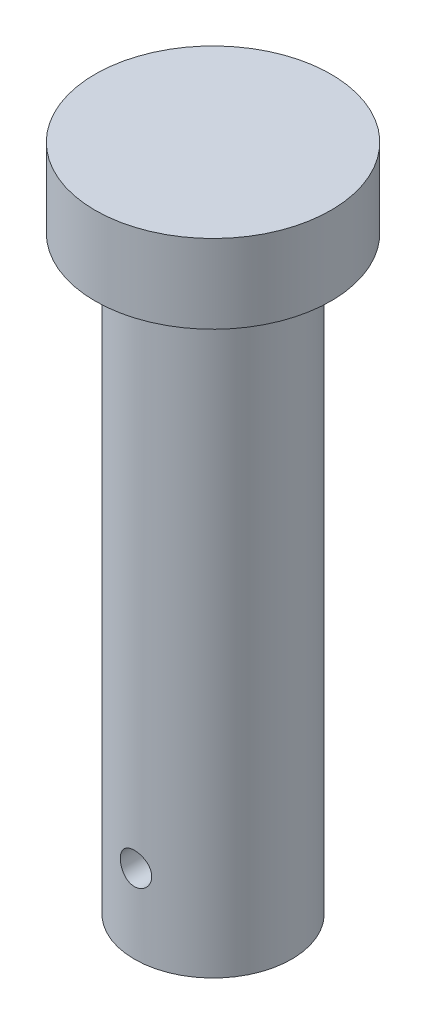
ISO-10303-21;
HEADER;
FILE_DESCRIPTION(('STEP AP214'),'2;1');
FILE_NAME('part.step','',(''),(''),'','','');
FILE_SCHEMA(('AUTOMOTIVE_DESIGN { 1 0 10303 214 1 1 1 1 }'));
ENDSEC;
DATA;
#1=APPLICATION_CONTEXT('core data for automotive mechanical design processes');
#2=APPLICATION_PROTOCOL_DEFINITION('international standard','automotive_design',2000,#1);
#3=PRODUCT_CONTEXT('',#1,'mechanical');
#4=PRODUCT('Part','Part','',(#3));
#5=PRODUCT_RELATED_PRODUCT_CATEGORY('part','',(#4));
#6=PRODUCT_DEFINITION_FORMATION('','',#4);
#7=PRODUCT_DEFINITION_CONTEXT('part definition',#1,'design');
#8=PRODUCT_DEFINITION('design','',#6,#7);
#9=PRODUCT_DEFINITION_SHAPE('','',#8);
#10=(LENGTH_UNIT() NAMED_UNIT(*) SI_UNIT(.MILLI.,.METRE.));
#11=(NAMED_UNIT(*) PLANE_ANGLE_UNIT() SI_UNIT($,.RADIAN.));
#12=(NAMED_UNIT(*) SI_UNIT($,.STERADIAN.) SOLID_ANGLE_UNIT());
#13=UNCERTAINTY_MEASURE_WITH_UNIT(LENGTH_MEASURE(1.E-05),#10,'distance_accuracy_value','');
#14=(GEOMETRIC_REPRESENTATION_CONTEXT(3) GLOBAL_UNCERTAINTY_ASSIGNED_CONTEXT((#13)) GLOBAL_UNIT_ASSIGNED_CONTEXT((#10,
#11,#12)) REPRESENTATION_CONTEXT('',''));
#15=CARTESIAN_POINT('',(0.,0.,0.));
#16=DIRECTION('',(0.,0.,1.));
#17=DIRECTION('',(1.,0.,0.));
#18=AXIS2_PLACEMENT_3D('',#15,#16,#17);
#19=CARTESIAN_POINT('',(0.,75.,0.));
#20=DIRECTION('',(0.,-1.,0.));
#21=DIRECTION('',(0.,0.,-1.));
#22=AXIS2_PLACEMENT_3D('',#19,#20,#21);
#23=CYLINDRICAL_SURFACE('',#22,10.);
#24=CARTESIAN_POINT('',(-1.3345414330707,8.75221504611304,-9.91054989208054));
#25=CARTESIAN_POINT('',(-1.26434001160468,8.67737931838805,-9.92000238711793));
#26=CARTESIAN_POINT('',(-1.18779034601462,8.60843754104146,-9.92954876533396));
#27=CARTESIAN_POINT('',(-1.0240968005732,8.48428570760716,-9.94776381112325));
#28=CARTESIAN_POINT('',(-0.936943837154803,8.42908755039092,-9.95643171431279));
#29=CARTESIAN_POINT('',(-0.754455787617089,8.33403708508488,-9.9719191282984));
#30=CARTESIAN_POINT('',(-0.659119581179457,8.29418688230148,-9.97873838547442));
#31=CARTESIAN_POINT('',(-0.462988382117304,8.23105406001255,-9.98975864671353));
#32=CARTESIAN_POINT('',(-0.362194838782022,8.20776706486175,-9.993960342244));
#33=CARTESIAN_POINT('',(-0.159027842962661,8.17861217094757,-9.99924670221558));
#34=CARTESIAN_POINT('',(-0.0566788667817966,8.17257909823512,-10.0003609202364));
#35=CARTESIAN_POINT('',(0.147578727369162,8.17765037861649,-9.9994325090812));
#36=CARTESIAN_POINT('',(0.249487351663036,8.18875448478203,-9.99738992539121));
#37=CARTESIAN_POINT('',(0.44912878317679,8.22759470702044,-9.99040475090428));
#38=CARTESIAN_POINT('',(0.546888388620701,8.25519762459616,-9.98548539175123));
#39=CARTESIAN_POINT('',(0.736382128264923,8.32609922377935,-9.97330256701339));
#40=CARTESIAN_POINT('',(0.82811592319331,8.3693987882638,-9.96603896957659));
#41=CARTESIAN_POINT('',(1.00387674975945,8.47092026837859,-9.94987937859779));
#42=CARTESIAN_POINT('',(1.08782626942956,8.52927406598134,-9.94096916632972));
#43=CARTESIAN_POINT('',(1.24481286212879,8.65909677146714,-9.9225349225076));
#44=CARTESIAN_POINT('',(1.3178490063124,8.73056679452975,-9.91301083880512));
#45=CARTESIAN_POINT('',(1.45182388466178,8.88562383279582,-9.89428359991917));
#46=CARTESIAN_POINT('',(1.5126083464185,8.96934489718785,-9.88508561132624));
#47=CARTESIAN_POINT('',(1.61923395647637,9.14595603094304,-9.86818155637202));
#48=CARTESIAN_POINT('',(1.6650756238825,9.23884578164466,-9.8604754381877));
#49=CARTESIAN_POINT('',(1.74024272498875,9.43069729101442,-9.84748759415155));
#50=CARTESIAN_POINT('',(1.76965163886854,9.52962547396235,-9.84219364006158));
#51=CARTESIAN_POINT('',(1.81138245581335,9.73113049044606,-9.83459966678573));
#52=CARTESIAN_POINT('',(1.82370637538496,9.83370689192411,-9.83229929427556));
#53=CARTESIAN_POINT('',(1.83081226950608,10.0378077549855,-9.830978497407));
#54=CARTESIAN_POINT('',(1.8258766879674,10.1393221384593,-9.83190526136557));
#55=CARTESIAN_POINT('',(1.79924693395261,10.3400487577321,-9.83681301798227));
#56=CARTESIAN_POINT('',(1.77755301604938,10.4392610284784,-9.84079396424485));
#57=CARTESIAN_POINT('',(1.71817327838287,10.632292660141,-9.85133384700966));
#58=CARTESIAN_POINT('',(1.68053628718216,10.7261275023939,-9.85788490758253));
#59=CARTESIAN_POINT('',(1.59038504092085,10.9061955336615,-9.87282906007023));
#60=CARTESIAN_POINT('',(1.53786943836437,10.9924280332348,-9.88122231881002));
#61=CARTESIAN_POINT('',(1.4185469681406,11.1562189605628,-9.89906085628549));
#62=CARTESIAN_POINT('',(1.35154060739489,11.233630577078,-9.90851983398097));
#63=CARTESIAN_POINT('',(1.20555149087414,11.3762104007564,-9.92733860479846));
#64=CARTESIAN_POINT('',(1.12656788847826,11.4413777416936,-9.93669839085895));
#65=CARTESIAN_POINT('',(0.957859063552198,11.5583076183189,-9.95438415454675));
#66=CARTESIAN_POINT('',(0.868028529481388,11.6099202106808,-9.96269807795029));
#67=CARTESIAN_POINT('',(0.680813747773546,11.6973150784983,-9.97723892305915));
#68=CARTESIAN_POINT('',(0.583429950119665,11.7330982961334,-9.98346596897207));
#69=CARTESIAN_POINT('',(0.384687640415485,11.787526458744,-9.99308901587484));
#70=CARTESIAN_POINT('',(0.283367152566916,11.8063062015811,-9.99650726369328));
#71=CARTESIAN_POINT('',(0.0789589128839722,11.8266264279617,-10.0002104625573));
#72=CARTESIAN_POINT('',(-0.0241286920404467,11.8281683376844,-10.000495672816));
#73=CARTESIAN_POINT('',(-0.227795900800379,11.8140561363665,-9.99791765110976));
#74=CARTESIAN_POINT('',(-0.328390756219347,11.7986137023108,-9.99509317492404));
#75=CARTESIAN_POINT('',(-0.525530205804138,11.7513447332201,-9.98666898440008));
#76=CARTESIAN_POINT('',(-0.622074714367128,11.7195178520933,-9.98106921143881));
#77=CARTESIAN_POINT('',(-0.808737062156857,11.6402993147056,-9.96768457918682));
#78=CARTESIAN_POINT('',(-0.898834045338809,11.5928597012985,-9.95989299823522));
#79=CARTESIAN_POINT('',(-1.06984524588666,11.4837854485885,-9.94297870041878));
#80=CARTESIAN_POINT('',(-1.15075859714424,11.4221494720844,-9.93385585818785));
#81=CARTESIAN_POINT('',(-1.30227384189784,11.2854228759279,-9.91513991517711));
#82=CARTESIAN_POINT('',(-1.37271966325886,11.2101598544902,-9.90554209083863));
#83=CARTESIAN_POINT('',(-1.50000643314238,11.0488115148095,-9.88706877232799));
#84=CARTESIAN_POINT('',(-1.55684707438102,10.9627259521978,-9.87819329447358));
#85=CARTESIAN_POINT('',(-1.6553994512315,10.7818792359233,-9.86215807834705));
#86=CARTESIAN_POINT('',(-1.6970765057771,10.6870988077313,-9.85500228573734));
#87=CARTESIAN_POINT('',(-1.76383931337243,10.4917169300109,-9.84327331689999));
#88=CARTESIAN_POINT('',(-1.78892732938162,10.3911162764734,-9.83869978843056));
#89=CARTESIAN_POINT('',(-1.82146928540086,10.1885479206741,-9.83272711071381));
#90=CARTESIAN_POINT('',(-1.82917992710476,10.08662279877,-9.83128176426829));
#91=CARTESIAN_POINT('',(-1.82747626584029,9.88290650837314,-9.83159863260272));
#92=CARTESIAN_POINT('',(-1.81806022532119,9.78111535452032,-9.83336117283192));
#93=CARTESIAN_POINT('',(-1.78258616096536,9.58163244803055,-9.83985274262039));
#94=CARTESIAN_POINT('',(-1.7566940645752,9.48391005706706,-9.84455218678868));
#95=CARTESIAN_POINT('',(-1.68922188252381,9.29425831545457,-9.8563529537969));
#96=CARTESIAN_POINT('',(-1.64765351211854,9.20232469844102,-9.86345248258664));
#97=CARTESIAN_POINT('',(-1.56244891680455,9.04895786631758,-9.87725182824322));
#98=CARTESIAN_POINT('',(-1.52200106487899,8.98569572043169,-9.88359772261684));
#99=CARTESIAN_POINT('',(-1.43367767832994,8.86464644984659,-9.89679568029342));
#100=CARTESIAN_POINT('',(-1.38580193423159,8.80685947962752,-9.90364775786846));
#101=CARTESIAN_POINT('',(-1.3345414330707,8.75221504611304,-9.91054989208054));
#102=B_SPLINE_CURVE_WITH_KNOTS('',3,(#24,#25,#26,#27,#28,#29,#30,#31,#32,#33,#34,#35,#36,#37,
#38,#39,#40,#41,#42,#43,#44,#45,#46,#47,#48,#49,#50,#51,#52,#53,#54,#55,#56,#57,#58,#59,#60,#61,
#62,#63,#64,#65,#66,#67,#68,#69,#70,#71,#72,#73,#74,#75,#76,#77,#78,#79,#80,#81,#82,#83,#84,#85,
#86,#87,#88,#89,#90,#91,#92,#93,#94,#95,#96,#97,#98,#99,#100,#101),.UNSPECIFIED.,.T.,.F.,(4,2,2,
2,2,2,2,2,2,2,2,2,2,2,2,2,2,2,2,2,2,2,2,2,2,2,2,2,2,2,2,2,2,2,2,2,2,2,4),(0.,0.308861145648771,
0.617988772689953,0.927158788231697,1.23624709729979,1.54236639654866,1.84848128498958,
2.15215760265528,2.45585100361548,2.76230101508982,3.06877709391464,3.37889958641533,
3.68901130427173,3.99753295470687,4.30601818786768,4.60947898931162,4.9129351810277,
5.21546862700742,5.51802948098544,5.82505601273617,6.13210425702604,6.4424182206664,
6.7527137116349,7.06052717946616,7.36831518003564,7.67231022709796,7.97631169576865,
8.28125581032666,8.58622866030916,8.89537035079486,9.20451902283388,9.51437037764781,
9.82417945600391,10.1293811162621,10.4346137418255,10.7368200490768,11.0388009564149,
11.2643224661669,11.4898503370341),.UNSPECIFIED.);
#103=CARTESIAN_POINT('',(-1.3345414330707,8.75221504611304,-9.91054989208054));
#104=VERTEX_POINT('',#103);
#105=EDGE_CURVE('E61',#104,#104,#102,.T.);
#106=ORIENTED_EDGE('',*,*,#105,.T.);
#107=EDGE_LOOP('',(#106));
#108=FACE_BOUND('',#107,.T.);
#109=CARTESIAN_POINT('',(0.,75.,0.));
#110=DIRECTION('',(0.,1.,0.));
#111=DIRECTION('',(0.,0.,1.));
#112=AXIS2_PLACEMENT_3D('',#109,#110,#111);
#113=CIRCLE('',#112,10.);
#114=CARTESIAN_POINT('',(0.,75.,10.));
#115=VERTEX_POINT('',#114);
#116=EDGE_CURVE('E10',#115,#115,#113,.T.);
#117=ORIENTED_EDGE('',*,*,#116,.F.);
#118=EDGE_LOOP('',(#117));
#119=FACE_BOUND('',#118,.T.);
#120=CARTESIAN_POINT('',(0.,0.,0.));
#121=DIRECTION('',(0.,1.,0.));
#122=DIRECTION('',(0.,0.,1.));
#123=AXIS2_PLACEMENT_3D('',#120,#121,#122);
#124=CIRCLE('',#123,10.);
#125=CARTESIAN_POINT('',(0.,0.,10.));
#126=VERTEX_POINT('',#125);
#127=EDGE_CURVE('E50',#126,#126,#124,.T.);
#128=ORIENTED_EDGE('',*,*,#127,.T.);
#129=EDGE_LOOP('',(#128));
#130=FACE_BOUND('',#129,.T.);
#131=CARTESIAN_POINT('',(-2.,10.,9.79795897113271));
#132=CARTESIAN_POINT('',(-1.99999589175054,9.88887124901769,9.79796118053292));
#133=CARTESIAN_POINT('',(-1.99070634343629,9.77769075333332,9.79987016537404));
#134=CARTESIAN_POINT('',(-1.95382456716568,9.55847498971374,9.80728862609749));
#135=CARTESIAN_POINT('',(-1.92621769414099,9.45044231072804,9.81280098289574));
#136=CARTESIAN_POINT('',(-1.85359156523949,9.24072539329158,9.82677747443709));
#137=CARTESIAN_POINT('',(-1.80858962830524,9.13903495693482,9.8352386724215));
#138=CARTESIAN_POINT('',(-1.70249821534101,8.94465031060609,9.85415598961317));
#139=CARTESIAN_POINT('',(-1.6414096372023,8.8519555989242,9.86461199746922));
#140=CARTESIAN_POINT('',(-1.50395815130687,8.67687799229228,9.88650599388505));
#141=CARTESIAN_POINT('',(-1.42741131182664,8.59464082423205,9.89795475674493));
#142=CARTESIAN_POINT('',(-1.26161357804262,8.44408493284204,9.92044944605197));
#143=CARTESIAN_POINT('',(-1.17236179395597,8.37576718516561,9.93149534421663));
#144=CARTESIAN_POINT('',(-0.98272271184851,8.25442396474308,9.95205592835124));
#145=CARTESIAN_POINT('',(-0.88224513534442,8.20153697236672,9.96155642883101));
#146=CARTESIAN_POINT('',(-0.673608300774542,8.11345012590373,9.97783473767263));
#147=CARTESIAN_POINT('',(-0.565449762841106,8.07824861619802,9.98461280088238));
#148=CARTESIAN_POINT('',(-0.346033546556988,8.02698561276075,9.99460641376837));
#149=CARTESIAN_POINT('',(-0.234835478429628,8.01067804485799,9.99786772576254));
#150=CARTESIAN_POINT('',(-0.0112371368750719,7.99689809632337,10.0006184236721));
#151=CARTESIAN_POINT('',(0.101163019663687,7.99942390070836,10.0001081730552));
#152=CARTESIAN_POINT('',(0.322284001487178,8.02305236043111,9.99540869737031));
#153=CARTESIAN_POINT('',(0.431034428596941,8.04388995433569,9.99127196731676));
#154=CARTESIAN_POINT('',(0.643463253160603,8.10313006491779,9.97984354318817));
#155=CARTESIAN_POINT('',(0.747141447494259,8.14153328438375,9.97255172288078));
#156=CARTESIAN_POINT('',(0.947238926401775,8.23506008029454,9.95554592039917));
#157=CARTESIAN_POINT('',(1.0436083482678,8.29028750220978,9.94581696350447));
#158=CARTESIAN_POINT('',(1.22581009171951,8.4158181544732,9.92500938947571));
#159=CARTESIAN_POINT('',(1.31164119905,8.48612311954103,9.91393061710444));
#160=CARTESIAN_POINT('',(1.47190286210692,8.64126724421695,9.89141928728919));
#161=CARTESIAN_POINT('',(1.54610863314726,8.72633837345918,9.87998392915032));
#162=CARTESIAN_POINT('',(1.67923698635361,8.90783288490151,9.85823143197521));
#163=CARTESIAN_POINT('',(1.7381592794555,9.00425648176639,9.84791431409096));
#164=CARTESIAN_POINT('',(1.83912562960376,9.20604166364361,9.82956094945847));
#165=CARTESIAN_POINT('',(1.88113329555542,9.31142193527933,9.82152963127098));
#166=CARTESIAN_POINT('',(1.94678068325516,9.52794264744798,9.80872952642545));
#167=CARTESIAN_POINT('',(1.97042279891329,9.63908233523817,9.80396031456855));
#168=CARTESIAN_POINT('',(1.9983320120721,9.86192971599809,9.79830958535655));
#169=CARTESIAN_POINT('',(2.00292371779582,9.97359514862069,9.79736294114308));
#170=CARTESIAN_POINT('',(1.99347525662148,10.1960964463994,9.79928971377707));
#171=CARTESIAN_POINT('',(1.97943614624488,10.3069323582377,9.80216291400776));
#172=CARTESIAN_POINT('',(1.93340441614831,10.5235372805845,9.81134464989829));
#173=CARTESIAN_POINT('',(1.9015852416786,10.6293446860715,9.81761998028993));
#174=CARTESIAN_POINT('',(1.82108207061703,10.8341265580575,9.83286978703329));
#175=CARTESIAN_POINT('',(1.77239668474635,10.9331004608714,9.84184448572539));
#176=CARTESIAN_POINT('',(1.65880828443119,11.1228262199003,9.86162811924079));
#177=CARTESIAN_POINT('',(1.59370215596551,11.2134540926017,9.87245943729806));
#178=CARTESIAN_POINT('',(1.44939114442542,11.3826166240018,9.89467447653273));
#179=CARTESIAN_POINT('',(1.37018481028907,11.4611500364985,9.90605825447636));
#180=CARTESIAN_POINT('',(1.19846454699578,11.6051251183712,9.92830691738431));
#181=CARTESIAN_POINT('',(1.10576499785926,11.6703473093,9.93916115417367));
#182=CARTESIAN_POINT('',(0.910535793269511,11.7842917629992,9.9589425525724));
#183=CARTESIAN_POINT('',(0.808006550867013,11.8330147186896,9.96786979510422));
#184=CARTESIAN_POINT('',(0.596605361648025,11.9122577434933,9.98274588122132));
#185=CARTESIAN_POINT('',(0.487773346956156,11.9428810364525,9.98871158285205));
#186=CARTESIAN_POINT('',(0.266378909359823,11.9853824953277,9.99706471875323));
#187=CARTESIAN_POINT('',(0.153816937422423,11.9972629189514,9.99945258399698));
#188=CARTESIAN_POINT('',(-0.0697457878072436,12.0018539619258,10.0003708090823));
#189=CARTESIAN_POINT('',(-0.18073962428299,11.9948945609125,9.99896757098659));
#190=CARTESIAN_POINT('',(-0.399942062631301,11.9627320989043,9.99260087120678));
#191=CARTESIAN_POINT('',(-0.508150699507446,11.9375292673037,9.98763745428862));
#192=CARTESIAN_POINT('',(-0.718505499490131,11.8697420158168,9.97470996729841));
#193=CARTESIAN_POINT('',(-0.82066488648033,11.8271972437381,9.9667527449523));
#194=CARTESIAN_POINT('',(-1.01644244037214,11.7259755173378,9.9486944424736));
#195=CARTESIAN_POINT('',(-1.11005993153569,11.667297288191,9.93859319293976));
#196=CARTESIAN_POINT('',(-1.28772778021183,11.5343612258774,9.9171519831348));
#197=CARTESIAN_POINT('',(-1.37159943222969,11.4598673272325,9.90579466835801));
#198=CARTESIAN_POINT('',(-1.52576523551701,11.2978995198025,9.8832244581573));
#199=CARTESIAN_POINT('',(-1.59605616641783,11.2104225410401,9.87201159757438));
#200=CARTESIAN_POINT('',(-1.72178443889996,11.0238413666191,9.85086685467863));
#201=CARTESIAN_POINT('',(-1.77705362923618,10.9246220777575,9.84095007142451));
#202=CARTESIAN_POINT('',(-1.87004809853245,10.7181344534798,9.82370474252826));
#203=CARTESIAN_POINT('',(-1.90778929194833,10.6108735226256,9.81637385049968));
#204=CARTESIAN_POINT('',(-1.95733827971531,10.4194750891143,9.8065936227569));
#205=CARTESIAN_POINT('',(-1.97330779704737,10.3364291609721,9.80337569829212));
#206=CARTESIAN_POINT('',(-1.99464003591942,10.1689320908977,9.79905756918168));
#207=CARTESIAN_POINT('',(-2.00000312312529,10.0844809975111,9.79795729152836));
#208=CARTESIAN_POINT('',(-2.,10.,9.79795897113271));
#209=B_SPLINE_CURVE_WITH_KNOTS('',3,(#131,#132,#133,#134,#135,#136,#137,#138,#139,#140,#141,
#142,#143,#144,#145,#146,#147,#148,#149,#150,#151,#152,#153,#154,#155,#156,#157,#158,#159,#160,
#161,#162,#163,#164,#165,#166,#167,#168,#169,#170,#171,#172,#173,#174,#175,#176,#177,#178,#179,
#180,#181,#182,#183,#184,#185,#186,#187,#188,#189,#190,#191,#192,#193,#194,#195,#196,#197,#198,
#199,#200,#201,#202,#203,#204,#205,#206,#207,#208),.UNSPECIFIED.,.T.,.F.,(4,2,2,2,2,2,2,2,2,2,2,
2,2,2,2,2,2,2,2,2,2,2,2,2,2,2,2,2,2,2,2,2,2,2,2,2,2,2,4),(0.,0.333076927738856,
0.666420478568594,0.999432995881172,1.33242692971973,1.66964505096874,2.00688680070844,
2.34706800874901,2.6872173649312,3.02288497766161,3.35852024232497,3.68937579267075,
4.02024458147501,4.35319848444606,4.68619071540132,5.02498693524967,5.36378956245441,
5.70331726345553,6.0428007003205,6.37647515609188,6.71013069056843,7.04058683566638,
7.37107020708797,7.70586119549042,8.04068665740418,8.38065203466902,8.7206031326021,
9.058596271573,9.39654869383256,9.72862034829372,10.0606878273351,10.392000341509,
10.7233390426937,11.0600230405119,11.3967867777956,11.7371779715921,12.077259501804,
12.3304760727632,12.5836839137096),.UNSPECIFIED.);
#210=CARTESIAN_POINT('',(-2.,10.,9.79795897113271));
#211=VERTEX_POINT('',#210);
#212=EDGE_CURVE('E41',#211,#211,#209,.T.);
#213=ORIENTED_EDGE('',*,*,#212,.F.);
#214=EDGE_LOOP('',(#213));
#215=FACE_BOUND('',#214,.T.);
#216=ADVANCED_FACE('F37',(#108,#119,#130,#215),#23,.T.);
#217=CARTESIAN_POINT('',(0.,0.,0.));
#218=DIRECTION('',(0.,1.,0.));
#219=DIRECTION('',(0.,0.,1.));
#220=AXIS2_PLACEMENT_3D('',#217,#218,#219);
#221=PLANE('',#220);
#222=ORIENTED_EDGE('',*,*,#127,.F.);
#223=EDGE_LOOP('',(#222));
#224=FACE_BOUND('',#223,.T.);
#225=ADVANCED_FACE('F87',(#224),#221,.F.);
#226=CARTESIAN_POINT('',(0.,85.,0.));
#227=DIRECTION('',(0.,-1.,0.));
#228=DIRECTION('',(0.,0.,-1.));
#229=AXIS2_PLACEMENT_3D('',#226,#227,#228);
#230=CYLINDRICAL_SURFACE('',#229,15.);
#231=CARTESIAN_POINT('',(0.,85.,0.));
#232=DIRECTION('',(0.,1.,0.));
#233=DIRECTION('',(0.,0.,1.));
#234=AXIS2_PLACEMENT_3D('',#231,#232,#233);
#235=CIRCLE('',#234,15.);
#236=CARTESIAN_POINT('',(0.,85.,15.));
#237=VERTEX_POINT('',#236);
#238=EDGE_CURVE('E56',#237,#237,#235,.T.);
#239=ORIENTED_EDGE('',*,*,#238,.F.);
#240=EDGE_LOOP('',(#239));
#241=FACE_BOUND('',#240,.T.);
#242=CARTESIAN_POINT('',(0.,75.,0.));
#243=DIRECTION('',(0.,1.,0.));
#244=DIRECTION('',(0.,0.,1.));
#245=AXIS2_PLACEMENT_3D('',#242,#243,#244);
#246=CIRCLE('',#245,15.);
#247=CARTESIAN_POINT('',(0.,75.,15.));
#248=VERTEX_POINT('',#247);
#249=EDGE_CURVE('E59',#248,#248,#246,.T.);
#250=ORIENTED_EDGE('',*,*,#249,.T.);
#251=EDGE_LOOP('',(#250));
#252=FACE_BOUND('',#251,.T.);
#253=ADVANCED_FACE('F82',(#241,#252),#230,.T.);
#254=CARTESIAN_POINT('',(0.,85.,0.));
#255=DIRECTION('',(0.,1.,0.));
#256=DIRECTION('',(0.,0.,1.));
#257=AXIS2_PLACEMENT_3D('',#254,#255,#256);
#258=PLANE('',#257);
#259=ORIENTED_EDGE('',*,*,#238,.T.);
#260=EDGE_LOOP('',(#259));
#261=FACE_BOUND('',#260,.T.);
#262=ADVANCED_FACE('F79',(#261),#258,.T.);
#263=CARTESIAN_POINT('',(0.,75.,0.));
#264=DIRECTION('',(0.,1.,0.));
#265=DIRECTION('',(0.,0.,1.));
#266=AXIS2_PLACEMENT_3D('',#263,#264,#265);
#267=PLANE('',#266);
#268=ORIENTED_EDGE('',*,*,#116,.T.);
#269=EDGE_LOOP('',(#268));
#270=FACE_BOUND('',#269,.T.);
#271=ORIENTED_EDGE('',*,*,#249,.F.);
#272=EDGE_LOOP('',(#271));
#273=FACE_BOUND('',#272,.T.);
#274=ADVANCED_FACE('F77',(#270,#273),#267,.F.);
#275=CARTESIAN_POINT('',(0.,10.,30.));
#276=DIRECTION('',(0.,0.,-1.));
#277=DIRECTION('',(-1.,0.,0.));
#278=AXIS2_PLACEMENT_3D('',#275,#276,#277);
#279=CYLINDRICAL_SURFACE('',#278,2.);
#280=CARTESIAN_POINT('',(0.,10.,0.));
#281=DIRECTION('',(0.,0.,1.));
#282=DIRECTION('',(1.,0.,0.));
#283=AXIS2_PLACEMENT_3D('',#280,#281,#282);
#284=CIRCLE('',#283,2.);
#285=CARTESIAN_POINT('',(2.,10.,0.));
#286=VERTEX_POINT('',#285);
#287=EDGE_CURVE('E68',#286,#286,#284,.T.);
#288=ORIENTED_EDGE('',*,*,#287,.F.);
#289=EDGE_LOOP('',(#288));
#290=FACE_BOUND('',#289,.T.);
#291=ORIENTED_EDGE('',*,*,#212,.T.);
#292=EDGE_LOOP('',(#291));
#293=FACE_BOUND('',#292,.T.);
#294=ADVANCED_FACE('F72',(#290,#293),#279,.F.);
#295=CARTESIAN_POINT('',(0.,10.,0.));
#296=DIRECTION('',(0.,0.,1.));
#297=DIRECTION('',(1.,0.,0.));
#298=AXIS2_PLACEMENT_3D('',#295,#296,#297);
#299=CONICAL_SURFACE('',#298,2.,0.0174532925199433);
#300=ORIENTED_EDGE('',*,*,#287,.T.);
#301=EDGE_LOOP('',(#300));
#302=FACE_BOUND('',#301,.T.);
#303=ORIENTED_EDGE('',*,*,#105,.F.);
#304=EDGE_LOOP('',(#303));
#305=FACE_BOUND('',#304,.T.);
#306=ADVANCED_FACE('F69',(#302,#305),#299,.F.);
#307=CLOSED_SHELL('',(#216,#225,#253,#262,#274,#294,#306));
#308=MANIFOLD_SOLID_BREP('B2',#307);
#309=ADVANCED_BREP_SHAPE_REPRESENTATION('',(#18,#308),#14);
#310=SHAPE_DEFINITION_REPRESENTATION(#9,#309);
ENDSEC;
END-ISO-10303-21;
